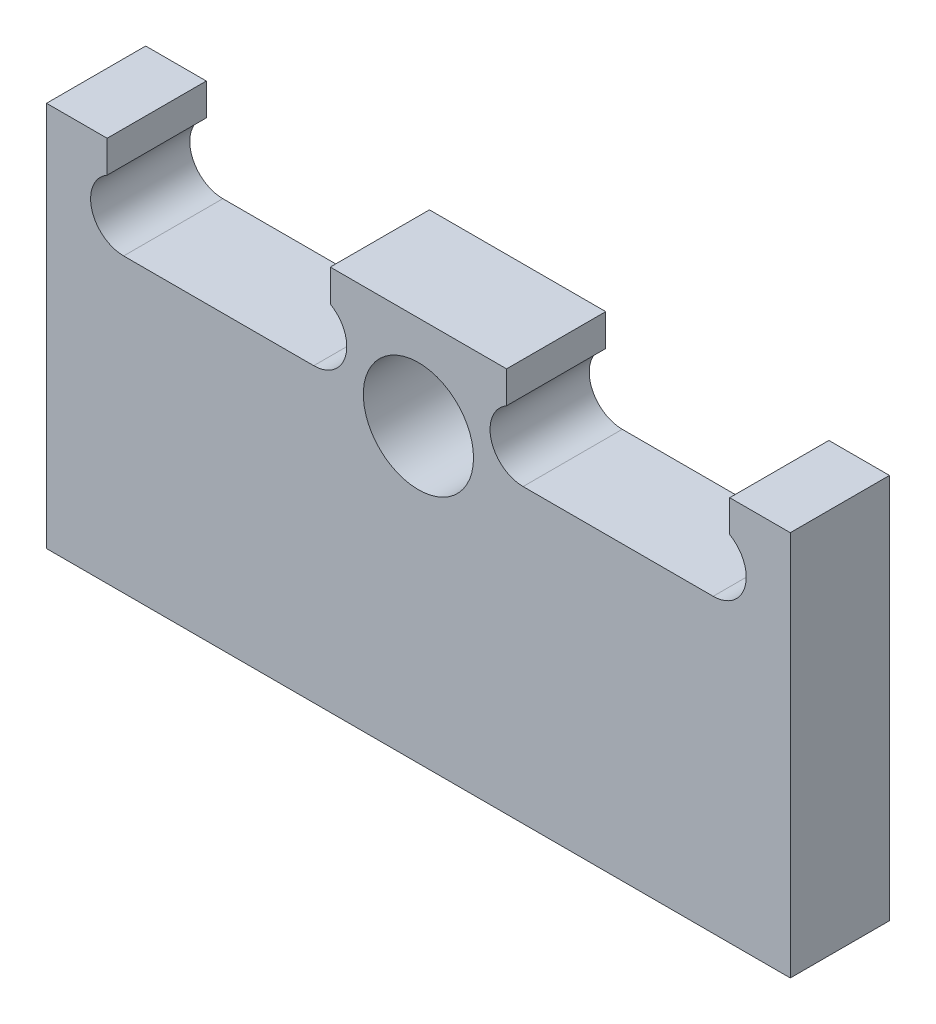
ISO-10303-21;
HEADER;
FILE_DESCRIPTION(('STEP AP214'),'2;1');
FILE_NAME('part.step','',(''),(''),'','','');
FILE_SCHEMA(('AUTOMOTIVE_DESIGN { 1 0 10303 214 1 1 1 1 }'));
ENDSEC;
DATA;
#1=APPLICATION_CONTEXT('core data for automotive mechanical design processes');
#2=APPLICATION_PROTOCOL_DEFINITION('international standard','automotive_design',2000,#1);
#3=PRODUCT_CONTEXT('',#1,'mechanical');
#4=PRODUCT('Part','Part','',(#3));
#5=PRODUCT_RELATED_PRODUCT_CATEGORY('part','',(#4));
#6=PRODUCT_DEFINITION_FORMATION('','',#4);
#7=PRODUCT_DEFINITION_CONTEXT('part definition',#1,'design');
#8=PRODUCT_DEFINITION('design','',#6,#7);
#9=PRODUCT_DEFINITION_SHAPE('','',#8);
#10=(LENGTH_UNIT() NAMED_UNIT(*) SI_UNIT(.MILLI.,.METRE.));
#11=(NAMED_UNIT(*) PLANE_ANGLE_UNIT() SI_UNIT($,.RADIAN.));
#12=(NAMED_UNIT(*) SI_UNIT($,.STERADIAN.) SOLID_ANGLE_UNIT());
#13=UNCERTAINTY_MEASURE_WITH_UNIT(LENGTH_MEASURE(1.E-05),#10,'distance_accuracy_value','');
#14=(GEOMETRIC_REPRESENTATION_CONTEXT(3) GLOBAL_UNCERTAINTY_ASSIGNED_CONTEXT((#13)) GLOBAL_UNIT_ASSIGNED_CONTEXT((#10,
#11,#12)) REPRESENTATION_CONTEXT('',''));
#15=CARTESIAN_POINT('',(0.,0.,0.));
#16=DIRECTION('',(0.,0.,1.));
#17=DIRECTION('',(1.,0.,0.));
#18=AXIS2_PLACEMENT_3D('',#15,#16,#17);
#19=CARTESIAN_POINT('',(14.,59.,18.));
#20=DIRECTION('',(0.,0.,1.));
#21=DIRECTION('',(1.,0.,0.));
#22=AXIS2_PLACEMENT_3D('',#19,#20,#21);
#23=PLANE('',#22);
#24=DIRECTION('',(1.,0.,0.));
#25=VECTOR('',#24,1.);
#26=CARTESIAN_POINT('',(135.,0.,18.));
#27=LINE('',#26,#25);
#28=CARTESIAN_POINT('',(0.,0.,18.));
#29=VERTEX_POINT('',#28);
#30=CARTESIAN_POINT('',(135.,0.,18.));
#31=VERTEX_POINT('',#30);
#32=EDGE_CURVE('E236',#29,#31,#27,.T.);
#33=ORIENTED_EDGE('',*,*,#32,.T.);
#34=DIRECTION('',(0.,1.,0.));
#35=VECTOR('',#34,1.);
#36=CARTESIAN_POINT('',(135.,70.,18.));
#37=LINE('',#36,#35);
#38=CARTESIAN_POINT('',(135.,70.,18.));
#39=VERTEX_POINT('',#38);
#40=EDGE_CURVE('E124',#31,#39,#37,.T.);
#41=ORIENTED_EDGE('',*,*,#40,.T.);
#42=DIRECTION('',(-1.,0.,0.));
#43=VECTOR('',#42,1.);
#44=CARTESIAN_POINT('',(124.,70.,18.));
#45=LINE('',#44,#43);
#46=CARTESIAN_POINT('',(124.,70.,18.));
#47=VERTEX_POINT('',#46);
#48=EDGE_CURVE('E289',#39,#47,#45,.T.);
#49=ORIENTED_EDGE('',*,*,#48,.T.);
#50=DIRECTION('',(0.,-1.,0.));
#51=VECTOR('',#50,1.);
#52=CARTESIAN_POINT('',(124.,70.,18.));
#53=LINE('',#52,#51);
#54=CARTESIAN_POINT('',(124.,64.1961524227067,18.));
#55=VERTEX_POINT('',#54);
#56=EDGE_CURVE('E309',#47,#55,#53,.T.);
#57=ORIENTED_EDGE('',*,*,#56,.T.);
#58=CARTESIAN_POINT('',(121.,59.,18.));
#59=DIRECTION('',(0.,0.,-1.));
#60=DIRECTION('',(-1.,0.,0.));
#61=AXIS2_PLACEMENT_3D('',#58,#59,#60);
#62=CIRCLE('',#61,5.99999999999999);
#63=CARTESIAN_POINT('',(121.,53.,18.));
#64=VERTEX_POINT('',#63);
#65=EDGE_CURVE('E305',#55,#64,#62,.T.);
#66=ORIENTED_EDGE('',*,*,#65,.T.);
#67=DIRECTION('',(-1.,0.,0.));
#68=VECTOR('',#67,1.);
#69=CARTESIAN_POINT('',(86.5,53.,18.));
#70=LINE('',#69,#68);
#71=CARTESIAN_POINT('',(86.5,53.,18.));
#72=VERTEX_POINT('',#71);
#73=EDGE_CURVE('E308',#64,#72,#70,.T.);
#74=ORIENTED_EDGE('',*,*,#73,.T.);
#75=CARTESIAN_POINT('',(86.5,59.,18.));
#76=DIRECTION('',(0.,0.,-1.));
#77=DIRECTION('',(-1.,0.,0.));
#78=AXIS2_PLACEMENT_3D('',#75,#76,#77);
#79=CIRCLE('',#78,6.00000000000001);
#80=CARTESIAN_POINT('',(83.5,64.1961524227067,18.));
#81=VERTEX_POINT('',#80);
#82=EDGE_CURVE('E313',#72,#81,#79,.T.);
#83=ORIENTED_EDGE('',*,*,#82,.T.);
#84=DIRECTION('',(0.,1.,0.));
#85=VECTOR('',#84,1.);
#86=CARTESIAN_POINT('',(83.5,70.,18.));
#87=LINE('',#86,#85);
#88=CARTESIAN_POINT('',(83.5,70.,18.));
#89=VERTEX_POINT('',#88);
#90=EDGE_CURVE('E320',#81,#89,#87,.T.);
#91=ORIENTED_EDGE('',*,*,#90,.T.);
#92=DIRECTION('',(-1.,0.,0.));
#93=VECTOR('',#92,1.);
#94=CARTESIAN_POINT('',(51.5,70.,18.));
#95=LINE('',#94,#93);
#96=CARTESIAN_POINT('',(51.5,70.,18.));
#97=VERTEX_POINT('',#96);
#98=EDGE_CURVE('E323',#89,#97,#95,.T.);
#99=ORIENTED_EDGE('',*,*,#98,.T.);
#100=DIRECTION('',(0.,-1.,0.));
#101=VECTOR('',#100,1.);
#102=CARTESIAN_POINT('',(51.5,70.,18.));
#103=LINE('',#102,#101);
#104=CARTESIAN_POINT('',(51.5,64.1961524227067,18.));
#105=VERTEX_POINT('',#104);
#106=EDGE_CURVE('E326',#97,#105,#103,.T.);
#107=ORIENTED_EDGE('',*,*,#106,.T.);
#108=CARTESIAN_POINT('',(48.5,59.,18.));
#109=DIRECTION('',(0.,0.,-1.));
#110=DIRECTION('',(1.,0.,0.));
#111=AXIS2_PLACEMENT_3D('',#108,#109,#110);
#112=CIRCLE('',#111,6.00000000000001);
#113=CARTESIAN_POINT('',(48.5,53.,18.));
#114=VERTEX_POINT('',#113);
#115=EDGE_CURVE('E329',#105,#114,#112,.T.);
#116=ORIENTED_EDGE('',*,*,#115,.T.);
#117=DIRECTION('',(-1.,0.,0.));
#118=VECTOR('',#117,1.);
#119=CARTESIAN_POINT('',(48.5,53.,18.));
#120=LINE('',#119,#118);
#121=CARTESIAN_POINT('',(14.,53.,18.));
#122=VERTEX_POINT('',#121);
#123=EDGE_CURVE('E332',#114,#122,#120,.T.);
#124=ORIENTED_EDGE('',*,*,#123,.T.);
#125=CARTESIAN_POINT('',(14.,59.,18.));
#126=DIRECTION('',(0.,0.,-1.));
#127=DIRECTION('',(1.,0.,0.));
#128=AXIS2_PLACEMENT_3D('',#125,#126,#127);
#129=CIRCLE('',#128,6.);
#130=CARTESIAN_POINT('',(11.,64.1961524227066,18.));
#131=VERTEX_POINT('',#130);
#132=EDGE_CURVE('E167',#122,#131,#129,.T.);
#133=ORIENTED_EDGE('',*,*,#132,.T.);
#134=DIRECTION('',(0.,1.,0.));
#135=VECTOR('',#134,1.);
#136=CARTESIAN_POINT('',(11.,70.,18.));
#137=LINE('',#136,#135);
#138=CARTESIAN_POINT('',(11.,70.,18.));
#139=VERTEX_POINT('',#138);
#140=EDGE_CURVE('E161',#131,#139,#137,.T.);
#141=ORIENTED_EDGE('',*,*,#140,.T.);
#142=DIRECTION('',(-1.,0.,0.));
#143=VECTOR('',#142,1.);
#144=CARTESIAN_POINT('',(0.,70.,18.));
#145=LINE('',#144,#143);
#146=CARTESIAN_POINT('',(0.,70.,18.));
#147=VERTEX_POINT('',#146);
#148=EDGE_CURVE('E165',#139,#147,#145,.T.);
#149=ORIENTED_EDGE('',*,*,#148,.T.);
#150=DIRECTION('',(0.,-1.,0.));
#151=VECTOR('',#150,1.);
#152=CARTESIAN_POINT('',(0.,0.,18.));
#153=LINE('',#152,#151);
#154=EDGE_CURVE('E57',#147,#29,#153,.T.);
#155=ORIENTED_EDGE('',*,*,#154,.T.);
#156=EDGE_LOOP('',(#33,#41,#49,#57,#66,#74,#83,#91,#99,#107,#116,#124,#133,#141,#149,#155));
#157=FACE_BOUND('',#156,.T.);
#158=CARTESIAN_POINT('',(67.5,53.,18.));
#159=DIRECTION('',(0.,0.,1.));
#160=DIRECTION('',(1.,0.,0.));
#161=AXIS2_PLACEMENT_3D('',#158,#159,#160);
#162=CIRCLE('',#161,9.99999999999999);
#163=CARTESIAN_POINT('',(77.5,53.,18.));
#164=VERTEX_POINT('',#163);
#165=EDGE_CURVE('E194',#164,#164,#162,.T.);
#166=ORIENTED_EDGE('',*,*,#165,.F.);
#167=EDGE_LOOP('',(#166));
#168=FACE_BOUND('',#167,.T.);
#169=ADVANCED_FACE('F39',(#157,#168),#23,.T.);
#170=CARTESIAN_POINT('',(14.,59.,0.));
#171=DIRECTION('',(0.,0.,1.));
#172=DIRECTION('',(1.,0.,0.));
#173=AXIS2_PLACEMENT_3D('',#170,#171,#172);
#174=PLANE('',#173);
#175=DIRECTION('',(1.,0.,0.));
#176=VECTOR('',#175,1.);
#177=CARTESIAN_POINT('',(135.,0.,0.));
#178=LINE('',#177,#176);
#179=CARTESIAN_POINT('',(0.,0.,0.));
#180=VERTEX_POINT('',#179);
#181=CARTESIAN_POINT('',(135.,0.,0.));
#182=VERTEX_POINT('',#181);
#183=EDGE_CURVE('E189',#180,#182,#178,.T.);
#184=ORIENTED_EDGE('',*,*,#183,.F.);
#185=DIRECTION('',(0.,-1.,0.));
#186=VECTOR('',#185,1.);
#187=CARTESIAN_POINT('',(0.,0.,0.));
#188=LINE('',#187,#186);
#189=CARTESIAN_POINT('',(0.,70.,0.));
#190=VERTEX_POINT('',#189);
#191=EDGE_CURVE('E116',#190,#180,#188,.T.);
#192=ORIENTED_EDGE('',*,*,#191,.F.);
#193=DIRECTION('',(-1.,0.,0.));
#194=VECTOR('',#193,1.);
#195=CARTESIAN_POINT('',(0.,70.,0.));
#196=LINE('',#195,#194);
#197=CARTESIAN_POINT('',(11.,70.,0.));
#198=VERTEX_POINT('',#197);
#199=EDGE_CURVE('E110',#198,#190,#196,.T.);
#200=ORIENTED_EDGE('',*,*,#199,.F.);
#201=DIRECTION('',(0.,1.,0.));
#202=VECTOR('',#201,1.);
#203=CARTESIAN_POINT('',(11.,70.,0.));
#204=LINE('',#203,#202);
#205=CARTESIAN_POINT('',(11.,64.1961524227066,0.));
#206=VERTEX_POINT('',#205);
#207=EDGE_CURVE('E176',#206,#198,#204,.T.);
#208=ORIENTED_EDGE('',*,*,#207,.F.);
#209=CARTESIAN_POINT('',(14.,59.,0.));
#210=DIRECTION('',(0.,0.,-1.));
#211=DIRECTION('',(1.,0.,0.));
#212=AXIS2_PLACEMENT_3D('',#209,#210,#211);
#213=CIRCLE('',#212,6.);
#214=CARTESIAN_POINT('',(14.,53.,0.));
#215=VERTEX_POINT('',#214);
#216=EDGE_CURVE('E227',#215,#206,#213,.T.);
#217=ORIENTED_EDGE('',*,*,#216,.F.);
#218=DIRECTION('',(-1.,0.,0.));
#219=VECTOR('',#218,1.);
#220=CARTESIAN_POINT('',(48.5,53.,0.));
#221=LINE('',#220,#219);
#222=CARTESIAN_POINT('',(48.5,53.,0.));
#223=VERTEX_POINT('',#222);
#224=EDGE_CURVE('E224',#223,#215,#221,.T.);
#225=ORIENTED_EDGE('',*,*,#224,.F.);
#226=CARTESIAN_POINT('',(48.5,59.,0.));
#227=DIRECTION('',(0.,0.,-1.));
#228=DIRECTION('',(1.,0.,0.));
#229=AXIS2_PLACEMENT_3D('',#226,#227,#228);
#230=CIRCLE('',#229,6.00000000000001);
#231=CARTESIAN_POINT('',(51.5,64.1961524227067,0.));
#232=VERTEX_POINT('',#231);
#233=EDGE_CURVE('E221',#232,#223,#230,.T.);
#234=ORIENTED_EDGE('',*,*,#233,.F.);
#235=DIRECTION('',(0.,-1.,0.));
#236=VECTOR('',#235,1.);
#237=CARTESIAN_POINT('',(51.5,70.,0.));
#238=LINE('',#237,#236);
#239=CARTESIAN_POINT('',(51.5,70.,0.));
#240=VERTEX_POINT('',#239);
#241=EDGE_CURVE('E218',#240,#232,#238,.T.);
#242=ORIENTED_EDGE('',*,*,#241,.F.);
#243=DIRECTION('',(-1.,0.,0.));
#244=VECTOR('',#243,1.);
#245=CARTESIAN_POINT('',(51.5,70.,0.));
#246=LINE('',#245,#244);
#247=CARTESIAN_POINT('',(83.5,70.,0.));
#248=VERTEX_POINT('',#247);
#249=EDGE_CURVE('E215',#248,#240,#246,.T.);
#250=ORIENTED_EDGE('',*,*,#249,.F.);
#251=DIRECTION('',(0.,1.,0.));
#252=VECTOR('',#251,1.);
#253=CARTESIAN_POINT('',(83.5,70.,0.));
#254=LINE('',#253,#252);
#255=CARTESIAN_POINT('',(83.5,64.1961524227067,0.));
#256=VERTEX_POINT('',#255);
#257=EDGE_CURVE('E212',#256,#248,#254,.T.);
#258=ORIENTED_EDGE('',*,*,#257,.F.);
#259=CARTESIAN_POINT('',(86.5,59.,0.));
#260=DIRECTION('',(0.,0.,-1.));
#261=DIRECTION('',(-1.,0.,0.));
#262=AXIS2_PLACEMENT_3D('',#259,#260,#261);
#263=CIRCLE('',#262,6.00000000000001);
#264=CARTESIAN_POINT('',(86.5,53.,0.));
#265=VERTEX_POINT('',#264);
#266=EDGE_CURVE('E209',#265,#256,#263,.T.);
#267=ORIENTED_EDGE('',*,*,#266,.F.);
#268=DIRECTION('',(-1.,0.,0.));
#269=VECTOR('',#268,1.);
#270=CARTESIAN_POINT('',(86.5,53.,0.));
#271=LINE('',#270,#269);
#272=CARTESIAN_POINT('',(121.,53.,0.));
#273=VERTEX_POINT('',#272);
#274=EDGE_CURVE('E206',#273,#265,#271,.T.);
#275=ORIENTED_EDGE('',*,*,#274,.F.);
#276=CARTESIAN_POINT('',(121.,59.,0.));
#277=DIRECTION('',(0.,0.,-1.));
#278=DIRECTION('',(-1.,0.,0.));
#279=AXIS2_PLACEMENT_3D('',#276,#277,#278);
#280=CIRCLE('',#279,5.99999999999999);
#281=CARTESIAN_POINT('',(124.,64.1961524227067,0.));
#282=VERTEX_POINT('',#281);
#283=EDGE_CURVE('E203',#282,#273,#280,.T.);
#284=ORIENTED_EDGE('',*,*,#283,.F.);
#285=DIRECTION('',(0.,-1.,0.));
#286=VECTOR('',#285,1.);
#287=CARTESIAN_POINT('',(124.,70.,0.));
#288=LINE('',#287,#286);
#289=CARTESIAN_POINT('',(124.,70.,0.));
#290=VERTEX_POINT('',#289);
#291=EDGE_CURVE('E200',#290,#282,#288,.T.);
#292=ORIENTED_EDGE('',*,*,#291,.F.);
#293=DIRECTION('',(-1.,0.,0.));
#294=VECTOR('',#293,1.);
#295=CARTESIAN_POINT('',(124.,70.,0.));
#296=LINE('',#295,#294);
#297=CARTESIAN_POINT('',(135.,70.,0.));
#298=VERTEX_POINT('',#297);
#299=EDGE_CURVE('E197',#298,#290,#296,.T.);
#300=ORIENTED_EDGE('',*,*,#299,.F.);
#301=DIRECTION('',(0.,1.,0.));
#302=VECTOR('',#301,1.);
#303=CARTESIAN_POINT('',(135.,70.,0.));
#304=LINE('',#303,#302);
#305=EDGE_CURVE('E193',#182,#298,#304,.T.);
#306=ORIENTED_EDGE('',*,*,#305,.F.);
#307=EDGE_LOOP('',(#184,#192,#200,#208,#217,#225,#234,#242,#250,#258,#267,#275,#284,#292,#300,#306));
#308=FACE_BOUND('',#307,.T.);
#309=CARTESIAN_POINT('',(67.5,53.,0.));
#310=DIRECTION('',(0.,0.,1.));
#311=DIRECTION('',(1.,0.,0.));
#312=AXIS2_PLACEMENT_3D('',#309,#310,#311);
#313=CIRCLE('',#312,9.99999999999999);
#314=CARTESIAN_POINT('',(77.5,53.,0.));
#315=VERTEX_POINT('',#314);
#316=EDGE_CURVE('E533',#315,#315,#313,.T.);
#317=ORIENTED_EDGE('',*,*,#316,.T.);
#318=EDGE_LOOP('',(#317));
#319=FACE_BOUND('',#318,.T.);
#320=ADVANCED_FACE('F293',(#308,#319),#174,.F.);
#321=CARTESIAN_POINT('',(135.,0.,18.));
#322=DIRECTION('',(0.,1.,0.));
#323=DIRECTION('',(0.,0.,1.));
#324=AXIS2_PLACEMENT_3D('',#321,#322,#323);
#325=PLANE('',#324);
#326=ORIENTED_EDGE('',*,*,#183,.T.);
#327=DIRECTION('',(0.,0.,-1.));
#328=VECTOR('',#327,1.);
#329=CARTESIAN_POINT('',(135.,0.,18.));
#330=LINE('',#329,#328);
#331=EDGE_CURVE('E11',#31,#182,#330,.T.);
#332=ORIENTED_EDGE('',*,*,#331,.F.);
#333=ORIENTED_EDGE('',*,*,#32,.F.);
#334=DIRECTION('',(0.,0.,-1.));
#335=VECTOR('',#334,1.);
#336=CARTESIAN_POINT('',(0.,0.,18.));
#337=LINE('',#336,#335);
#338=EDGE_CURVE('E185',#29,#180,#337,.T.);
#339=ORIENTED_EDGE('',*,*,#338,.T.);
#340=EDGE_LOOP('',(#326,#332,#333,#339));
#341=FACE_BOUND('',#340,.T.);
#342=ADVANCED_FACE('F41',(#341),#325,.F.);
#343=CARTESIAN_POINT('',(135.,70.,18.));
#344=DIRECTION('',(-1.,0.,0.));
#345=DIRECTION('',(0.,-1.,0.));
#346=AXIS2_PLACEMENT_3D('',#343,#344,#345);
#347=PLANE('',#346);
#348=ORIENTED_EDGE('',*,*,#305,.T.);
#349=DIRECTION('',(0.,0.,-1.));
#350=VECTOR('',#349,1.);
#351=CARTESIAN_POINT('',(135.,70.,18.));
#352=LINE('',#351,#350);
#353=EDGE_CURVE('E49',#39,#298,#352,.T.);
#354=ORIENTED_EDGE('',*,*,#353,.F.);
#355=ORIENTED_EDGE('',*,*,#40,.F.);
#356=ORIENTED_EDGE('',*,*,#331,.T.);
#357=EDGE_LOOP('',(#348,#354,#355,#356));
#358=FACE_BOUND('',#357,.T.);
#359=ADVANCED_FACE('F368',(#358),#347,.F.);
#360=CARTESIAN_POINT('',(124.,70.,18.));
#361=DIRECTION('',(0.,-1.,0.));
#362=DIRECTION('',(1.,0.,0.));
#363=AXIS2_PLACEMENT_3D('',#360,#361,#362);
#364=PLANE('',#363);
#365=ORIENTED_EDGE('',*,*,#299,.T.);
#366=DIRECTION('',(0.,0.,-1.));
#367=VECTOR('',#366,1.);
#368=CARTESIAN_POINT('',(124.,70.,18.));
#369=LINE('',#368,#367);
#370=EDGE_CURVE('E279',#47,#290,#369,.T.);
#371=ORIENTED_EDGE('',*,*,#370,.F.);
#372=ORIENTED_EDGE('',*,*,#48,.F.);
#373=ORIENTED_EDGE('',*,*,#353,.T.);
#374=EDGE_LOOP('',(#365,#371,#372,#373));
#375=FACE_BOUND('',#374,.T.);
#376=ADVANCED_FACE('F287',(#375),#364,.F.);
#377=CARTESIAN_POINT('',(124.,70.,18.));
#378=DIRECTION('',(1.,0.,0.));
#379=DIRECTION('',(0.,1.,0.));
#380=AXIS2_PLACEMENT_3D('',#377,#378,#379);
#381=PLANE('',#380);
#382=ORIENTED_EDGE('',*,*,#291,.T.);
#383=DIRECTION('',(0.,0.,-1.));
#384=VECTOR('',#383,1.);
#385=CARTESIAN_POINT('',(124.,64.1961524227067,18.));
#386=LINE('',#385,#384);
#387=EDGE_CURVE('E275',#55,#282,#386,.T.);
#388=ORIENTED_EDGE('',*,*,#387,.F.);
#389=ORIENTED_EDGE('',*,*,#56,.F.);
#390=ORIENTED_EDGE('',*,*,#370,.T.);
#391=EDGE_LOOP('',(#382,#388,#389,#390));
#392=FACE_BOUND('',#391,.T.);
#393=ADVANCED_FACE('F299',(#392),#381,.F.);
#394=CARTESIAN_POINT('',(121.,59.,18.));
#395=DIRECTION('',(0.,0.,-1.));
#396=DIRECTION('',(-1.,0.,0.));
#397=AXIS2_PLACEMENT_3D('',#394,#395,#396);
#398=CYLINDRICAL_SURFACE('',#397,5.99999999999999);
#399=ORIENTED_EDGE('',*,*,#283,.T.);
#400=DIRECTION('',(0.,0.,-1.));
#401=VECTOR('',#400,1.);
#402=CARTESIAN_POINT('',(121.,53.,18.));
#403=LINE('',#402,#401);
#404=EDGE_CURVE('E271',#64,#273,#403,.T.);
#405=ORIENTED_EDGE('',*,*,#404,.F.);
#406=ORIENTED_EDGE('',*,*,#65,.F.);
#407=ORIENTED_EDGE('',*,*,#387,.T.);
#408=EDGE_LOOP('',(#399,#405,#406,#407));
#409=FACE_BOUND('',#408,.T.);
#410=ADVANCED_FACE('F303',(#409),#398,.F.);
#411=CARTESIAN_POINT('',(86.5,53.,18.));
#412=DIRECTION('',(0.,-1.,0.));
#413=DIRECTION('',(1.,0.,0.));
#414=AXIS2_PLACEMENT_3D('',#411,#412,#413);
#415=PLANE('',#414);
#416=ORIENTED_EDGE('',*,*,#274,.T.);
#417=DIRECTION('',(0.,0.,-1.));
#418=VECTOR('',#417,1.);
#419=CARTESIAN_POINT('',(86.5,53.,18.));
#420=LINE('',#419,#418);
#421=EDGE_CURVE('E267',#72,#265,#420,.T.);
#422=ORIENTED_EDGE('',*,*,#421,.F.);
#423=ORIENTED_EDGE('',*,*,#73,.F.);
#424=ORIENTED_EDGE('',*,*,#404,.T.);
#425=EDGE_LOOP('',(#416,#422,#423,#424));
#426=FACE_BOUND('',#425,.T.);
#427=ADVANCED_FACE('F381',(#426),#415,.F.);
#428=CARTESIAN_POINT('',(86.5,59.,18.));
#429=DIRECTION('',(0.,0.,-1.));
#430=DIRECTION('',(-1.,0.,0.));
#431=AXIS2_PLACEMENT_3D('',#428,#429,#430);
#432=CYLINDRICAL_SURFACE('',#431,6.00000000000001);
#433=ORIENTED_EDGE('',*,*,#266,.T.);
#434=DIRECTION('',(0.,0.,-1.));
#435=VECTOR('',#434,1.);
#436=CARTESIAN_POINT('',(83.5,64.1961524227067,18.));
#437=LINE('',#436,#435);
#438=EDGE_CURVE('E263',#81,#256,#437,.T.);
#439=ORIENTED_EDGE('',*,*,#438,.F.);
#440=ORIENTED_EDGE('',*,*,#82,.F.);
#441=ORIENTED_EDGE('',*,*,#421,.T.);
#442=EDGE_LOOP('',(#433,#439,#440,#441));
#443=FACE_BOUND('',#442,.T.);
#444=ADVANCED_FACE('F384',(#443),#432,.F.);
#445=CARTESIAN_POINT('',(83.5,70.,18.));
#446=DIRECTION('',(-1.,0.,0.));
#447=DIRECTION('',(0.,-1.,0.));
#448=AXIS2_PLACEMENT_3D('',#445,#446,#447);
#449=PLANE('',#448);
#450=ORIENTED_EDGE('',*,*,#257,.T.);
#451=DIRECTION('',(0.,0.,-1.));
#452=VECTOR('',#451,1.);
#453=CARTESIAN_POINT('',(83.5,70.,18.));
#454=LINE('',#453,#452);
#455=EDGE_CURVE('E259',#89,#248,#454,.T.);
#456=ORIENTED_EDGE('',*,*,#455,.F.);
#457=ORIENTED_EDGE('',*,*,#90,.F.);
#458=ORIENTED_EDGE('',*,*,#438,.T.);
#459=EDGE_LOOP('',(#450,#456,#457,#458));
#460=FACE_BOUND('',#459,.T.);
#461=ADVANCED_FACE('F388',(#460),#449,.F.);
#462=CARTESIAN_POINT('',(51.5,70.,18.));
#463=DIRECTION('',(0.,-1.,0.));
#464=DIRECTION('',(0.,0.,-1.));
#465=AXIS2_PLACEMENT_3D('',#462,#463,#464);
#466=PLANE('',#465);
#467=ORIENTED_EDGE('',*,*,#249,.T.);
#468=DIRECTION('',(0.,0.,-1.));
#469=VECTOR('',#468,1.);
#470=CARTESIAN_POINT('',(51.5,70.,18.));
#471=LINE('',#470,#469);
#472=EDGE_CURVE('E255',#97,#240,#471,.T.);
#473=ORIENTED_EDGE('',*,*,#472,.F.);
#474=ORIENTED_EDGE('',*,*,#98,.F.);
#475=ORIENTED_EDGE('',*,*,#455,.T.);
#476=EDGE_LOOP('',(#467,#473,#474,#475));
#477=FACE_BOUND('',#476,.T.);
#478=ADVANCED_FACE('F392',(#477),#466,.F.);
#479=CARTESIAN_POINT('',(51.5,70.,18.));
#480=DIRECTION('',(1.,0.,0.));
#481=DIRECTION('',(0.,1.,0.));
#482=AXIS2_PLACEMENT_3D('',#479,#480,#481);
#483=PLANE('',#482);
#484=ORIENTED_EDGE('',*,*,#241,.T.);
#485=DIRECTION('',(0.,0.,-1.));
#486=VECTOR('',#485,1.);
#487=CARTESIAN_POINT('',(51.5,64.1961524227067,18.));
#488=LINE('',#487,#486);
#489=EDGE_CURVE('E251',#105,#232,#488,.T.);
#490=ORIENTED_EDGE('',*,*,#489,.F.);
#491=ORIENTED_EDGE('',*,*,#106,.F.);
#492=ORIENTED_EDGE('',*,*,#472,.T.);
#493=EDGE_LOOP('',(#484,#490,#491,#492));
#494=FACE_BOUND('',#493,.T.);
#495=ADVANCED_FACE('F396',(#494),#483,.F.);
#496=CARTESIAN_POINT('',(48.5,59.,18.));
#497=DIRECTION('',(0.,0.,-1.));
#498=DIRECTION('',(-1.,0.,0.));
#499=AXIS2_PLACEMENT_3D('',#496,#497,#498);
#500=CYLINDRICAL_SURFACE('',#499,6.00000000000001);
#501=ORIENTED_EDGE('',*,*,#233,.T.);
#502=DIRECTION('',(0.,0.,-1.));
#503=VECTOR('',#502,1.);
#504=CARTESIAN_POINT('',(48.5,53.,18.));
#505=LINE('',#504,#503);
#506=EDGE_CURVE('E247',#114,#223,#505,.T.);
#507=ORIENTED_EDGE('',*,*,#506,.F.);
#508=ORIENTED_EDGE('',*,*,#115,.F.);
#509=ORIENTED_EDGE('',*,*,#489,.T.);
#510=EDGE_LOOP('',(#501,#507,#508,#509));
#511=FACE_BOUND('',#510,.T.);
#512=ADVANCED_FACE('F400',(#511),#500,.F.);
#513=CARTESIAN_POINT('',(48.5,53.,18.));
#514=DIRECTION('',(0.,-1.,0.));
#515=DIRECTION('',(1.,0.,0.));
#516=AXIS2_PLACEMENT_3D('',#513,#514,#515);
#517=PLANE('',#516);
#518=ORIENTED_EDGE('',*,*,#224,.T.);
#519=DIRECTION('',(0.,0.,-1.));
#520=VECTOR('',#519,1.);
#521=CARTESIAN_POINT('',(14.,53.,18.));
#522=LINE('',#521,#520);
#523=EDGE_CURVE('E243',#122,#215,#522,.T.);
#524=ORIENTED_EDGE('',*,*,#523,.F.);
#525=ORIENTED_EDGE('',*,*,#123,.F.);
#526=ORIENTED_EDGE('',*,*,#506,.T.);
#527=EDGE_LOOP('',(#518,#524,#525,#526));
#528=FACE_BOUND('',#527,.T.);
#529=ADVANCED_FACE('F340',(#528),#517,.F.);
#530=CARTESIAN_POINT('',(14.,59.,18.));
#531=DIRECTION('',(0.,0.,-1.));
#532=DIRECTION('',(-1.,0.,0.));
#533=AXIS2_PLACEMENT_3D('',#530,#531,#532);
#534=CYLINDRICAL_SURFACE('',#533,6.);
#535=ORIENTED_EDGE('',*,*,#216,.T.);
#536=DIRECTION('',(0.,0.,-1.));
#537=VECTOR('',#536,1.);
#538=CARTESIAN_POINT('',(11.,64.1961524227066,18.));
#539=LINE('',#538,#537);
#540=EDGE_CURVE('E178',#131,#206,#539,.T.);
#541=ORIENTED_EDGE('',*,*,#540,.F.);
#542=ORIENTED_EDGE('',*,*,#132,.F.);
#543=ORIENTED_EDGE('',*,*,#523,.T.);
#544=EDGE_LOOP('',(#535,#541,#542,#543));
#545=FACE_BOUND('',#544,.T.);
#546=ADVANCED_FACE('F344',(#545),#534,.F.);
#547=CARTESIAN_POINT('',(11.,70.,18.));
#548=DIRECTION('',(-1.,0.,0.));
#549=DIRECTION('',(0.,-1.,0.));
#550=AXIS2_PLACEMENT_3D('',#547,#548,#549);
#551=PLANE('',#550);
#552=ORIENTED_EDGE('',*,*,#207,.T.);
#553=DIRECTION('',(0.,0.,-1.));
#554=VECTOR('',#553,1.);
#555=CARTESIAN_POINT('',(11.,70.,18.));
#556=LINE('',#555,#554);
#557=EDGE_CURVE('E173',#139,#198,#556,.T.);
#558=ORIENTED_EDGE('',*,*,#557,.F.);
#559=ORIENTED_EDGE('',*,*,#140,.F.);
#560=ORIENTED_EDGE('',*,*,#540,.T.);
#561=EDGE_LOOP('',(#552,#558,#559,#560));
#562=FACE_BOUND('',#561,.T.);
#563=ADVANCED_FACE('F174',(#562),#551,.F.);
#564=CARTESIAN_POINT('',(0.,70.,18.));
#565=DIRECTION('',(0.,-1.,0.));
#566=DIRECTION('',(0.,0.,-1.));
#567=AXIS2_PLACEMENT_3D('',#564,#565,#566);
#568=PLANE('',#567);
#569=ORIENTED_EDGE('',*,*,#199,.T.);
#570=DIRECTION('',(0.,0.,-1.));
#571=VECTOR('',#570,1.);
#572=CARTESIAN_POINT('',(0.,70.,18.));
#573=LINE('',#572,#571);
#574=EDGE_CURVE('E179',#147,#190,#573,.T.);
#575=ORIENTED_EDGE('',*,*,#574,.F.);
#576=ORIENTED_EDGE('',*,*,#148,.F.);
#577=ORIENTED_EDGE('',*,*,#557,.T.);
#578=EDGE_LOOP('',(#569,#575,#576,#577));
#579=FACE_BOUND('',#578,.T.);
#580=ADVANCED_FACE('F181',(#579),#568,.F.);
#581=CARTESIAN_POINT('',(0.,0.,18.));
#582=DIRECTION('',(1.,0.,0.));
#583=DIRECTION('',(0.,0.,-1.));
#584=AXIS2_PLACEMENT_3D('',#581,#582,#583);
#585=PLANE('',#584);
#586=ORIENTED_EDGE('',*,*,#191,.T.);
#587=ORIENTED_EDGE('',*,*,#338,.F.);
#588=ORIENTED_EDGE('',*,*,#154,.F.);
#589=ORIENTED_EDGE('',*,*,#574,.T.);
#590=EDGE_LOOP('',(#586,#587,#588,#589));
#591=FACE_BOUND('',#590,.T.);
#592=ADVANCED_FACE('F348',(#591),#585,.F.);
#593=CARTESIAN_POINT('',(67.5,53.,18.));
#594=DIRECTION('',(0.,0.,-1.));
#595=DIRECTION('',(-1.,0.,0.));
#596=AXIS2_PLACEMENT_3D('',#593,#594,#595);
#597=CYLINDRICAL_SURFACE('',#596,9.99999999999999);
#598=ORIENTED_EDGE('',*,*,#165,.T.);
#599=EDGE_LOOP('',(#598));
#600=FACE_BOUND('',#599,.T.);
#601=ORIENTED_EDGE('',*,*,#316,.F.);
#602=EDGE_LOOP('',(#601));
#603=FACE_BOUND('',#602,.T.);
#604=ADVANCED_FACE('F350',(#600,#603),#597,.F.);
#605=CLOSED_SHELL('',(#169,#320,#342,#359,#376,#393,#410,#427,#444,#461,#478,#495,#512,#529,
#546,#563,#580,#592,#604));
#606=MANIFOLD_SOLID_BREP('B2',#605);
#607=ADVANCED_BREP_SHAPE_REPRESENTATION('',(#18,#606),#14);
#608=SHAPE_DEFINITION_REPRESENTATION(#9,#607);
ENDSEC;
END-ISO-10303-21;
